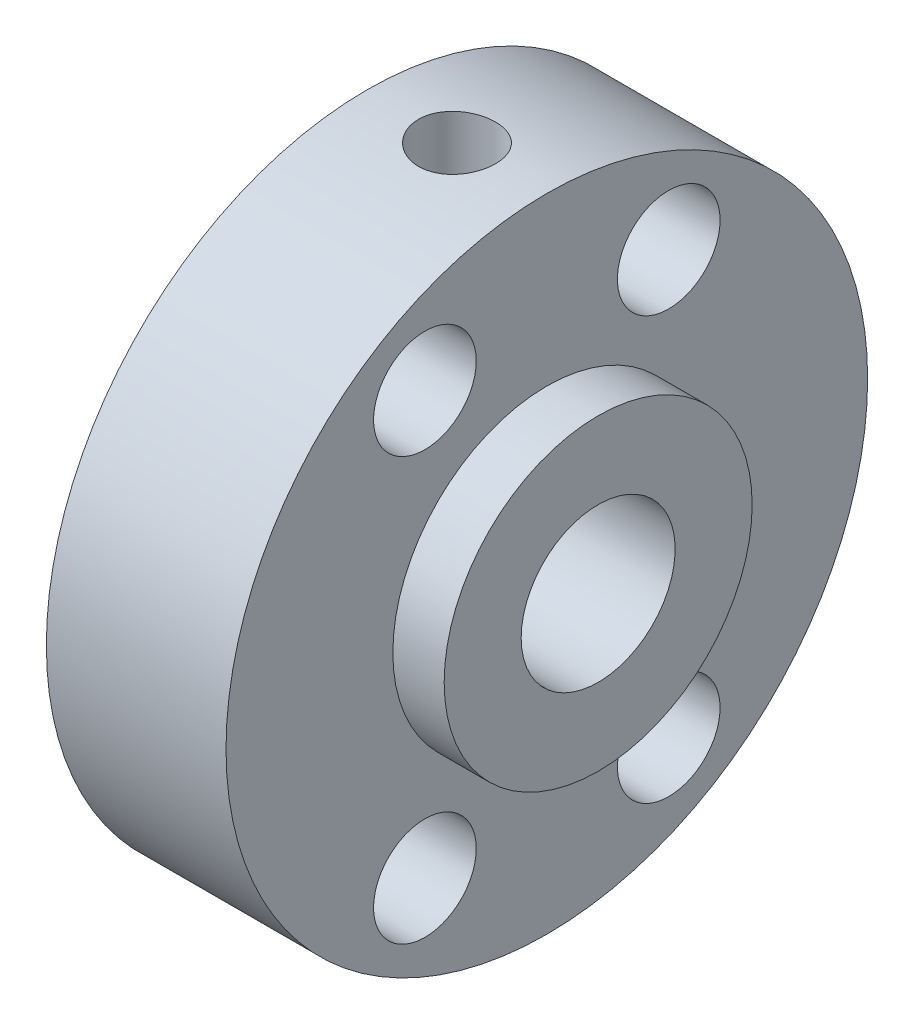
ISO-10303-21;
HEADER;
FILE_DESCRIPTION(('STEP AP214'),'2;1');
FILE_NAME('part.step','',(''),(''),'','','');
FILE_SCHEMA(('AUTOMOTIVE_DESIGN { 1 0 10303 214 1 1 1 1 }'));
ENDSEC;
DATA;
#1=APPLICATION_CONTEXT('core data for automotive mechanical design processes');
#2=APPLICATION_PROTOCOL_DEFINITION('international standard','automotive_design',2000,#1);
#3=PRODUCT_CONTEXT('',#1,'mechanical');
#4=PRODUCT('Part','Part','',(#3));
#5=PRODUCT_RELATED_PRODUCT_CATEGORY('part','',(#4));
#6=PRODUCT_DEFINITION_FORMATION('','',#4);
#7=PRODUCT_DEFINITION_CONTEXT('part definition',#1,'design');
#8=PRODUCT_DEFINITION('design','',#6,#7);
#9=PRODUCT_DEFINITION_SHAPE('','',#8);
#10=(LENGTH_UNIT() NAMED_UNIT(*) SI_UNIT(.MILLI.,.METRE.));
#11=(NAMED_UNIT(*) PLANE_ANGLE_UNIT() SI_UNIT($,.RADIAN.));
#12=(NAMED_UNIT(*) SI_UNIT($,.STERADIAN.) SOLID_ANGLE_UNIT());
#13=UNCERTAINTY_MEASURE_WITH_UNIT(LENGTH_MEASURE(1.E-05),#10,'distance_accuracy_value','');
#14=(GEOMETRIC_REPRESENTATION_CONTEXT(3) GLOBAL_UNCERTAINTY_ASSIGNED_CONTEXT((#13)) GLOBAL_UNIT_ASSIGNED_CONTEXT((#10,
#11,#12)) REPRESENTATION_CONTEXT('',''));
#15=CARTESIAN_POINT('',(0.,0.,0.));
#16=DIRECTION('',(0.,0.,1.));
#17=DIRECTION('',(1.,0.,0.));
#18=AXIS2_PLACEMENT_3D('',#15,#16,#17);
#19=CARTESIAN_POINT('',(0.,0.,0.));
#20=DIRECTION('',(-1.,0.,0.));
#21=DIRECTION('',(0.,0.,1.));
#22=AXIS2_PLACEMENT_3D('',#19,#20,#21);
#23=CYLINDRICAL_SURFACE('',#22,3.);
#24=CARTESIAN_POINT('',(9.,0.,0.));
#25=DIRECTION('',(-1.,0.,0.));
#26=DIRECTION('',(0.,0.,1.));
#27=AXIS2_PLACEMENT_3D('',#24,#25,#26);
#28=CIRCLE('',#27,3.);
#29=CARTESIAN_POINT('',(9.,0.,3.));
#30=VERTEX_POINT('',#29);
#31=EDGE_CURVE('E59',#30,#30,#28,.T.);
#32=ORIENTED_EDGE('',*,*,#31,.F.);
#33=EDGE_LOOP('',(#32));
#34=FACE_BOUND('',#33,.T.);
#35=CARTESIAN_POINT('',(0.,0.,0.));
#36=DIRECTION('',(-1.,0.,0.));
#37=DIRECTION('',(0.,0.,1.));
#38=AXIS2_PLACEMENT_3D('',#35,#36,#37);
#39=CIRCLE('',#38,3.);
#40=CARTESIAN_POINT('',(0.,0.,3.));
#41=VERTEX_POINT('',#40);
#42=EDGE_CURVE('E10',#41,#41,#39,.T.);
#43=ORIENTED_EDGE('',*,*,#42,.T.);
#44=EDGE_LOOP('',(#43));
#45=FACE_BOUND('',#44,.T.);
#46=CARTESIAN_POINT('',(3.5,2.59807621135332,-1.5));
#47=CARTESIAN_POINT('',(3.57816171229288,2.59808302092689,-1.4999945446118));
#48=CARTESIAN_POINT('',(3.65642211728757,2.60165701781635,-1.49384995609982));
#49=CARTESIAN_POINT('',(3.81054089701573,2.61543549678079,-1.46958481484708));
#50=CARTESIAN_POINT('',(3.88639387256511,2.62565391083339,-1.45143909683127));
#51=CARTESIAN_POINT('',(4.03317749651591,2.65124019908098,-1.40414992304972));
#52=CARTESIAN_POINT('',(4.10413197871038,2.66658065209878,-1.3750649287406));
#53=CARTESIAN_POINT('',(4.24013630299508,2.70063997225287,-1.30690128806456));
#54=CARTESIAN_POINT('',(4.30518582539369,2.71935902214097,-1.26782210105366));
#55=CARTESIAN_POINT('',(4.43345859283626,2.75995303586162,-1.17699981079632));
#56=CARTESIAN_POINT('',(4.49608870351032,2.7819609545693,-1.12447805421565));
#57=CARTESIAN_POINT('',(4.61211258261006,2.82557974178559,-1.0098807114217));
#58=CARTESIAN_POINT('',(4.66550174387528,2.84719040746875,-0.947800388673439));
#59=CARTESIAN_POINT('',(4.76505072672149,2.88932215429424,-0.810734345121818));
#60=CARTESIAN_POINT('',(4.81048065178929,2.90967159627259,-0.735160783518861));
#61=CARTESIAN_POINT('',(4.88771127986864,2.94526134149293,-0.576235539899255));
#62=CARTESIAN_POINT('',(4.91952058420575,2.96050486775612,-0.492888807207232));
#63=CARTESIAN_POINT('',(4.96625699195164,2.98320691866356,-0.327067415888966));
#64=CARTESIAN_POINT('',(4.9822242895333,2.99114220331338,-0.244952685733226));
#65=CARTESIAN_POINT('',(5.00024917801256,3.000113757691,-0.0788559430467724));
#66=CARTESIAN_POINT('',(5.00231518519356,3.00115420176885,0.00512490876560744));
#67=CARTESIAN_POINT('',(4.99287998904448,2.99644472874675,0.164748786635625));
#68=CARTESIAN_POINT('',(4.98254297671817,2.99127743838241,0.240481798765187));
#69=CARTESIAN_POINT('',(4.95067873414301,2.97561367889621,0.388970657877483));
#70=CARTESIAN_POINT('',(4.92915066653566,2.96511681099591,0.461726281640888));
#71=CARTESIAN_POINT('',(4.87537615086528,2.93957374931482,0.60346408735433));
#72=CARTESIAN_POINT('',(4.8429855302419,2.92446662293799,0.672380135272767));
#73=CARTESIAN_POINT('',(4.76860487569776,2.89106468980031,0.803965202269992));
#74=CARTESIAN_POINT('',(4.72661140504647,2.87276874236226,0.866631973257968));
#75=CARTESIAN_POINT('',(4.62965697270048,2.83266591598844,0.990260491347292));
#76=CARTESIAN_POINT('',(4.57384545751099,2.81069063997263,1.05050111254404));
#77=CARTESIAN_POINT('',(4.45311541260473,2.76681510880218,1.16115655544667));
#78=CARTESIAN_POINT('',(4.38818994158891,2.74491492398443,1.21156381736135));
#79=CARTESIAN_POINT('',(4.24602771136387,2.70216234138727,1.30425800196332));
#80=CARTESIAN_POINT('',(4.16827096541868,2.68146479986061,1.34582597246708));
#81=CARTESIAN_POINT('',(4.0055934929615,2.64563175417864,1.41497866950185));
#82=CARTESIAN_POINT('',(3.92068035047366,2.63049045069101,1.44257798731633));
#83=CARTESIAN_POINT('',(3.75317823307581,2.60916953725552,1.48077031653756));
#84=CARTESIAN_POINT('',(3.67093832143467,2.60237483772745,1.49253768317996));
#85=CARTESIAN_POINT('',(3.50539798772519,2.59676879042414,1.50227541991714));
#86=CARTESIAN_POINT('',(3.42209835632032,2.59795180333967,1.50025553597254));
#87=CARTESIAN_POINT('',(3.26651912213191,2.60751504810877,1.48355406501595));
#88=CARTESIAN_POINT('',(3.19403082333811,2.61509381259981,1.4702817250687));
#89=CARTESIAN_POINT('',(3.05244832059356,2.63541032327012,1.43354442694866));
#90=CARTESIAN_POINT('',(2.98335522388009,2.64814974007551,1.41007616793542));
#91=CARTESIAN_POINT('',(2.84688300364596,2.67804333119485,1.35247138290733));
#92=CARTESIAN_POINT('',(2.77973147471967,2.69537464864595,1.31789109553908));
#93=CARTESIAN_POINT('',(2.65179609269151,2.73234179245875,1.23943059602371));
#94=CARTESIAN_POINT('',(2.59101553473008,2.75197880032721,1.19554560649832));
#95=CARTESIAN_POINT('',(2.46953184871468,2.79431997684504,1.09325575079828));
#96=CARTESIAN_POINT('',(2.40980427392351,2.81709874731434,1.03371790847245));
#97=CARTESIAN_POINT('',(2.30088164300961,2.86101352466839,0.905106743097433));
#98=CARTESIAN_POINT('',(2.25169014465419,2.88214897511564,0.83603021198302));
#99=CARTESIAN_POINT('',(2.16413941107485,2.92112042536435,0.687803043838135));
#100=CARTESIAN_POINT('',(2.12610032268364,2.93885462508044,0.608434646361169));
#101=CARTESIAN_POINT('',(2.06429314421391,2.96825032438951,0.443283546961623));
#102=CARTESIAN_POINT('',(2.04051252295054,2.97991715514559,0.357506552088264));
#103=CARTESIAN_POINT('',(2.00994715373801,2.99501262272824,0.190469523495626));
#104=CARTESIAN_POINT('',(2.00180318618583,2.99909891862287,0.109517165775686));
#105=CARTESIAN_POINT('',(1.9987351018184,3.00063195562697,-0.0526889789268051));
#106=CARTESIAN_POINT('',(2.00380635721466,2.99808102100335,-0.13394265044263));
#107=CARTESIAN_POINT('',(2.02612461019344,2.98700953256884,-0.28880698847572));
#108=CARTESIAN_POINT('',(2.04254727388651,2.97889342001985,-0.362568476716895));
#109=CARTESIAN_POINT('',(2.08599049895446,2.95788140495135,-0.506168928275426));
#110=CARTESIAN_POINT('',(2.11301258014018,2.94498481699194,-0.576007327433263));
#111=CARTESIAN_POINT('',(2.17809057824896,2.9148889612218,-0.713135109367326));
#112=CARTESIAN_POINT('',(2.21656898481176,2.89752925798199,-0.780187714050069));
#113=CARTESIAN_POINT('',(2.30293689628858,2.86032199712739,-0.907161962721036));
#114=CARTESIAN_POINT('',(2.35083072367351,2.84047329837541,-0.96708031112236));
#115=CARTESIAN_POINT('',(2.46019570853405,2.79792915339941,-1.08437100623534));
#116=CARTESIAN_POINT('',(2.52254373121579,2.77514698517547,-1.14089652680891));
#117=CARTESIAN_POINT('',(2.65617608169466,2.73094614244278,-1.24299493109201));
#118=CARTESIAN_POINT('',(2.72746823130153,2.70952868642798,-1.28855812501509));
#119=CARTESIAN_POINT('',(2.87995496987143,2.66999407957374,-1.36864661967848));
#120=CARTESIAN_POINT('',(2.9613912966931,2.65200261384405,-1.40277759894141));
#121=CARTESIAN_POINT('',(3.12999860650967,2.62299234492527,-1.45631806425962));
#122=CARTESIAN_POINT('',(3.21714933336903,2.61195024221553,-1.47577678676302));
#123=CARTESIAN_POINT('',(3.33770803347799,2.60293908902686,-1.49155051179662));
#124=CARTESIAN_POINT('',(3.37005184159682,2.60112193507728,-1.49471415744578));
#125=CARTESIAN_POINT('',(3.43492472102337,2.59868903831625,-1.49894010763494));
#126=CARTESIAN_POINT('',(3.46745380457881,2.59807337587664,-1.50000227159981));
#127=CARTESIAN_POINT('',(3.5,2.59807621135332,-1.5));
#128=B_SPLINE_CURVE_WITH_KNOTS('',3,(#46,#47,#48,#49,#50,#51,#52,#53,#54,#55,#56,#57,#58,#59,
#60,#61,#62,#63,#64,#65,#66,#67,#68,#69,#70,#71,#72,#73,#74,#75,#76,#77,#78,#79,#80,#81,#82,#83,
#84,#85,#86,#87,#88,#89,#90,#91,#92,#93,#94,#95,#96,#97,#98,#99,#100,#101,#102,#103,#104,#105,
#106,#107,#108,#109,#110,#111,#112,#113,#114,#115,#116,#117,#118,#119,#120,#121,#122,#123,#124,
#125,#126,#127),.UNSPECIFIED.,.T.,.F.,(4,2,2,2,2,2,2,2,2,2,2,2,2,2,2,2,2,2,2,2,2,2,2,2,2,2,2,2,
2,2,2,2,2,2,2,2,2,2,2,2,4),(0.,0.234348183892073,0.469189339237207,0.702792893878327,
0.936409088167724,1.18929346874735,1.44230356626556,1.71236838358145,1.98226240445836,
2.23295227451903,2.4834903552906,2.71224146226807,2.94100968776182,3.1729430209672,
3.40495949025407,3.65890787185336,3.91305072368878,4.18333262594172,4.45333161317557,
4.70193436281317,4.95036139782559,5.17161275136038,5.39293578654094,5.62450944609131,
5.85620229330071,6.11710115370919,6.37808797467303,6.64596272119448,6.91360169713157,
7.1566840558423,7.39968130190957,7.62666637307238,7.85368400268019,8.09041126079207,
8.32724745151078,8.587653627751,8.84828914267731,9.11716123557907,9.38512699504139,
9.48270202777963,9.5802835874181),.UNSPECIFIED.);
#129=CARTESIAN_POINT('',(3.5,2.59807621135332,-1.5));
#130=VERTEX_POINT('',#129);
#131=EDGE_CURVE('E84',#130,#130,#128,.T.);
#132=ORIENTED_EDGE('',*,*,#131,.F.);
#133=EDGE_LOOP('',(#132));
#134=FACE_BOUND('',#133,.T.);
#135=ADVANCED_FACE('F31',(#34,#45,#134),#23,.F.);
#136=CARTESIAN_POINT('',(0.,0.,0.));
#137=DIRECTION('',(-1.,0.,0.));
#138=DIRECTION('',(0.,0.,1.));
#139=AXIS2_PLACEMENT_3D('',#136,#137,#138);
#140=CYLINDRICAL_SURFACE('',#139,12.5);
#141=CARTESIAN_POINT('',(0.,0.,0.));
#142=DIRECTION('',(-1.,0.,0.));
#143=DIRECTION('',(0.,0.,1.));
#144=AXIS2_PLACEMENT_3D('',#141,#142,#143);
#145=CIRCLE('',#144,12.5);
#146=CARTESIAN_POINT('',(0.,0.,12.5));
#147=VERTEX_POINT('',#146);
#148=EDGE_CURVE('E44',#147,#147,#145,.T.);
#149=ORIENTED_EDGE('',*,*,#148,.F.);
#150=EDGE_LOOP('',(#149));
#151=FACE_BOUND('',#150,.T.);
#152=CARTESIAN_POINT('',(7.,0.,0.));
#153=DIRECTION('',(-1.,0.,0.));
#154=DIRECTION('',(0.,0.,1.));
#155=AXIS2_PLACEMENT_3D('',#152,#153,#154);
#156=CIRCLE('',#155,12.5);
#157=CARTESIAN_POINT('',(7.,0.,12.5));
#158=VERTEX_POINT('',#157);
#159=EDGE_CURVE('E48',#158,#158,#156,.T.);
#160=ORIENTED_EDGE('',*,*,#159,.T.);
#161=EDGE_LOOP('',(#160));
#162=FACE_BOUND('',#161,.T.);
#163=CARTESIAN_POINT('',(3.5,12.4096736459909,-1.5));
#164=CARTESIAN_POINT('',(3.41607042940482,12.4096748089167,-1.49999641586388));
#165=CARTESIAN_POINT('',(3.3320877399393,12.4105342894214,-1.49293206748169));
#166=CARTESIAN_POINT('',(3.16645769398422,12.4138782255216,-1.46486159354819));
#167=CARTESIAN_POINT('',(3.08481290215949,12.4163643992983,-1.44384072619508));
#168=CARTESIAN_POINT('',(2.92628079724309,12.4226761552619,-1.38848417307918));
#169=CARTESIAN_POINT('',(2.84939036943189,12.426500849368,-1.35415731394874));
#170=CARTESIAN_POINT('',(2.70247642894952,12.4350576249844,-1.27318168778971));
#171=CARTESIAN_POINT('',(2.63245170421602,12.4397895458966,-1.22653510106007));
#172=CARTESIAN_POINT('',(2.50088011419491,12.4496550027324,-1.12198571965019));
#173=CARTESIAN_POINT('',(2.4393738528257,12.4547902908254,-1.06403198625323));
#174=CARTESIAN_POINT('',(2.32693564091905,12.4648680792729,-0.938622932174393));
#175=CARTESIAN_POINT('',(2.2760042070291,12.4698105701984,-0.871167147527067));
#176=CARTESIAN_POINT('',(2.18601673353186,12.4789637011531,-0.728414784233987));
#177=CARTESIAN_POINT('',(2.14699729213018,12.4831720690333,-0.653094976924494));
#178=CARTESIAN_POINT('',(2.08217576980763,12.4903635621621,-0.496912883636388));
#179=CARTESIAN_POINT('',(2.05637323512614,12.4933467294733,-0.41605078804277));
#180=CARTESIAN_POINT('',(2.01883887194828,12.4977393662263,-0.25149392849254));
#181=CARTESIAN_POINT('',(2.00703967327712,12.4991563682204,-0.167814735521689));
#182=CARTESIAN_POINT('',(1.99763820034474,12.5002827183051,0.000347248334282976));
#183=CARTESIAN_POINT('',(2.00003540892089,12.4999921286017,0.0848300098341701));
#184=CARTESIAN_POINT('',(2.01890456092568,12.4977421462633,0.251742833758765));
#185=CARTESIAN_POINT('',(2.0353040524862,12.4957913442169,0.334181218784106));
#186=CARTESIAN_POINT('',(2.081599075858,12.490449821119,0.495127185045588));
#187=CARTESIAN_POINT('',(2.11149484709083,12.4870590745233,0.573634696521302));
#188=CARTESIAN_POINT('',(2.18401136445326,12.4792038952277,0.724715561629688));
#189=CARTESIAN_POINT('',(2.22666361800321,12.4747368094346,0.797273648637692));
#190=CARTESIAN_POINT('',(2.32345944947808,12.465229048358,0.934229460099392));
#191=CARTESIAN_POINT('',(2.37760351320781,12.4601883488298,0.998626839383445));
#192=CARTESIAN_POINT('',(2.49625217477023,12.4500603372648,1.11785860561525));
#193=CARTESIAN_POINT('',(2.56081989068675,12.4449729316271,1.17263019439189));
#194=CARTESIAN_POINT('',(2.69826575683975,12.4353563023037,1.27056795912578));
#195=CARTESIAN_POINT('',(2.77114392958224,12.4308270801297,1.31373410365263));
#196=CARTESIAN_POINT('',(2.92319624507369,12.4228396027608,1.38723839179325));
#197=CARTESIAN_POINT('',(3.00237272062895,12.4193817467283,1.41757175578821));
#198=CARTESIAN_POINT('',(3.16474617975059,12.4139364153306,1.46449505016189));
#199=CARTESIAN_POINT('',(3.24794298505965,12.4119488748366,1.48108558929275));
#200=CARTESIAN_POINT('',(3.41544154818834,12.4096810007818,1.49996964356083));
#201=CARTESIAN_POINT('',(3.49973321794057,12.4093901280317,1.50235142135386));
#202=CARTESIAN_POINT('',(3.66751439042147,12.4105206650573,1.49298299027801));
#203=CARTESIAN_POINT('',(3.75100390884369,12.411942041265,1.48123305845624));
#204=CARTESIAN_POINT('',(3.91454789179899,12.4163273137489,1.44400895971009));
#205=CARTESIAN_POINT('',(3.99461217340466,12.4192864301079,1.41857731249469));
#206=CARTESIAN_POINT('',(4.14933964148798,12.4264098926624,1.35475538396312));
#207=CARTESIAN_POINT('',(4.22400265225152,12.4305742780457,1.31636468129306));
#208=CARTESIAN_POINT('',(4.36620814748731,12.4396643656649,1.22749651360805));
#209=CARTESIAN_POINT('',(4.43371414344065,12.4445936804928,1.17696103570738));
#210=CARTESIAN_POINT('',(4.5593175565059,12.4546467770184,1.06532008918353));
#211=CARTESIAN_POINT('',(4.61741463670294,12.4597705656719,1.0042142422181));
#212=CARTESIAN_POINT('',(4.72285987361746,12.4696675472455,0.87278213633386));
#213=CARTESIAN_POINT('',(4.77015012325571,12.4744387628015,0.802409249708916));
#214=CARTESIAN_POINT('',(4.85223910466455,12.483063621558,0.654668214705289));
#215=CARTESIAN_POINT('',(4.88703807118722,12.4869172820019,0.577300197822207));
#216=CARTESIAN_POINT('',(4.9430605024379,12.4932640215257,0.417959622359992));
#217=CARTESIAN_POINT('',(4.96431775994212,12.4957604851314,0.33599908532359));
#218=CARTESIAN_POINT('',(4.99276337179108,12.4991255682254,0.169640292495738));
#219=CARTESIAN_POINT('',(4.99995230834657,12.4999942550783,0.0852421377306299));
#220=CARTESIAN_POINT('',(5.00004692205616,12.5000056524324,-0.0830300031278303));
#221=CARTESIAN_POINT('',(4.99304201834161,12.4991591682624,-0.166903952329437));
#222=CARTESIAN_POINT('',(4.96513677254876,12.4958567701035,-0.332273612398118));
#223=CARTESIAN_POINT('',(4.94423643502524,12.4934008566421,-0.413769324044744));
#224=CARTESIAN_POINT('',(4.88916099243421,12.4871544009745,-0.572059777991808));
#225=CARTESIAN_POINT('',(4.85498981777275,12.4833642539575,-0.648855904373999));
#226=CARTESIAN_POINT('',(4.7743519652078,12.474869622158,-0.795637705262655));
#227=CARTESIAN_POINT('',(4.72788518779857,12.4701651299761,-0.865623324646851));
#228=CARTESIAN_POINT('',(4.62364315899687,12.4603319681132,-0.997254742124291));
#229=CARTESIAN_POINT('',(4.56580132233712,12.4552009088046,-1.0588476339384));
#230=CARTESIAN_POINT('',(4.44058848142378,12.4451123432295,-1.17148865356204));
#231=CARTESIAN_POINT('',(4.37321521774934,12.4401548784622,-1.22253427406543));
#232=CARTESIAN_POINT('',(4.23057853191475,12.4309559603764,-1.31278537364373));
#233=CARTESIAN_POINT('',(4.15528783586352,12.4267171228205,-1.35194799100155));
#234=CARTESIAN_POINT('',(3.99919112312461,12.419466118837,-1.41701902911872));
#235=CARTESIAN_POINT('',(3.91839126440112,12.4164526081981,-1.44294198213015));
#236=CARTESIAN_POINT('',(3.7809702304473,12.4127313618494,-1.4745350503682));
#237=CARTESIAN_POINT('',(3.72521862402006,12.4115903654975,-1.48407082470974));
#238=CARTESIAN_POINT('',(3.61298603393287,12.4100611186528,-1.49680448454755));
#239=CARTESIAN_POINT('',(3.5565050552187,12.4096728630583,-1.50000241299709));
#240=CARTESIAN_POINT('',(3.5,12.4096736459909,-1.5));
#241=B_SPLINE_CURVE_WITH_KNOTS('',3,(#163,#164,#165,#166,#167,#168,#169,#170,#171,#172,#173,
#174,#175,#176,#177,#178,#179,#180,#181,#182,#183,#184,#185,#186,#187,#188,#189,#190,#191,#192,
#193,#194,#195,#196,#197,#198,#199,#200,#201,#202,#203,#204,#205,#206,#207,#208,#209,#210,#211,
#212,#213,#214,#215,#216,#217,#218,#219,#220,#221,#222,#223,#224,#225,#226,#227,#228,#229,#230,
#231,#232,#233,#234,#235,#236,#237,#238,#239,#240),.UNSPECIFIED.,.T.,.F.,(4,2,2,2,2,2,2,2,2,2,2,
2,2,2,2,2,2,2,2,2,2,2,2,2,2,2,2,2,2,2,2,2,2,2,2,2,2,2,4),(0.,0.25158230660961,0.503430774819312,
0.755112462522262,1.0067496383611,1.25954776660377,1.51235824273611,1.76593780876769,
2.01950866836447,2.27185458608052,2.52419131111312,2.77523023079344,3.02627360403335,
3.27794222677635,3.52962149067918,3.78288622204422,4.03615163930559,4.28951130338294,
4.54285974404081,4.79463277043148,5.0464008609825,5.29739099483104,5.54838929022027,
5.80061125155308,6.05284224246467,6.30639464647639,6.55994228515918,6.81285470170487,
7.06575665136928,7.31707030939075,7.56838388503437,7.81962308616497,8.07086432058376,
8.32362252061905,8.57644073759112,8.83016031080822,9.08360079205962,9.25297814464871,
9.42235434931908),.UNSPECIFIED.);
#242=CARTESIAN_POINT('',(3.5,12.4096736459909,-1.5));
#243=VERTEX_POINT('',#242);
#244=EDGE_CURVE('E35',#243,#243,#241,.T.);
#245=ORIENTED_EDGE('',*,*,#244,.F.);
#246=EDGE_LOOP('',(#245));
#247=FACE_BOUND('',#246,.T.);
#248=ADVANCED_FACE('F125',(#151,#162,#247),#140,.T.);
#249=CARTESIAN_POINT('',(0.,3.,0.));
#250=DIRECTION('',(1.,0.,0.));
#251=DIRECTION('',(0.,0.,-1.));
#252=AXIS2_PLACEMENT_3D('',#249,#250,#251);
#253=PLANE('',#252);
#254=CARTESIAN_POINT('',(0.,8.22724133595217,-4.75000000000001));
#255=DIRECTION('',(1.,0.,0.));
#256=DIRECTION('',(0.,0.,-1.));
#257=AXIS2_PLACEMENT_3D('',#254,#255,#256);
#258=CIRCLE('',#257,2.);
#259=CARTESIAN_POINT('',(0.,8.22724133595217,-6.75000000000001));
#260=VERTEX_POINT('',#259);
#261=EDGE_CURVE('E66',#260,#260,#258,.T.);
#262=ORIENTED_EDGE('',*,*,#261,.T.);
#263=EDGE_LOOP('',(#262));
#264=FACE_BOUND('',#263,.T.);
#265=CARTESIAN_POINT('',(0.,-8.22724133595218,4.75000000000002));
#266=DIRECTION('',(1.,0.,0.));
#267=DIRECTION('',(0.,0.,-1.));
#268=AXIS2_PLACEMENT_3D('',#265,#266,#267);
#269=CIRCLE('',#268,2.);
#270=CARTESIAN_POINT('',(0.,-8.22724133595218,2.75000000000002));
#271=VERTEX_POINT('',#270);
#272=EDGE_CURVE('E72',#271,#271,#269,.T.);
#273=ORIENTED_EDGE('',*,*,#272,.T.);
#274=EDGE_LOOP('',(#273));
#275=FACE_BOUND('',#274,.T.);
#276=CARTESIAN_POINT('',(0.,-8.22724133595216,-4.75000000000002));
#277=DIRECTION('',(1.,0.,0.));
#278=DIRECTION('',(0.,0.,-1.));
#279=AXIS2_PLACEMENT_3D('',#276,#277,#278);
#280=CIRCLE('',#279,2.);
#281=CARTESIAN_POINT('',(0.,-8.22724133595216,-6.75000000000002));
#282=VERTEX_POINT('',#281);
#283=EDGE_CURVE('E73',#282,#282,#280,.T.);
#284=ORIENTED_EDGE('',*,*,#283,.T.);
#285=EDGE_LOOP('',(#284));
#286=FACE_BOUND('',#285,.T.);
#287=CARTESIAN_POINT('',(0.,8.22724133595216,4.75000000000001));
#288=DIRECTION('',(1.,0.,0.));
#289=DIRECTION('',(0.,0.,-1.));
#290=AXIS2_PLACEMENT_3D('',#287,#288,#289);
#291=CIRCLE('',#290,2.);
#292=CARTESIAN_POINT('',(0.,8.22724133595216,2.75000000000001));
#293=VERTEX_POINT('',#292);
#294=EDGE_CURVE('E62',#293,#293,#291,.T.);
#295=ORIENTED_EDGE('',*,*,#294,.T.);
#296=EDGE_LOOP('',(#295));
#297=FACE_BOUND('',#296,.T.);
#298=ORIENTED_EDGE('',*,*,#42,.F.);
#299=EDGE_LOOP('',(#298));
#300=FACE_BOUND('',#299,.T.);
#301=ORIENTED_EDGE('',*,*,#148,.T.);
#302=EDGE_LOOP('',(#301));
#303=FACE_BOUND('',#302,.T.);
#304=ADVANCED_FACE('F123',(#264,#275,#286,#297,#300,#303),#253,.F.);
#305=CARTESIAN_POINT('',(7.,12.5,0.));
#306=DIRECTION('',(-1.,0.,0.));
#307=DIRECTION('',(0.,0.,1.));
#308=AXIS2_PLACEMENT_3D('',#305,#306,#307);
#309=PLANE('',#308);
#310=CARTESIAN_POINT('',(7.,8.22724133595217,-4.75000000000001));
#311=DIRECTION('',(1.,0.,0.));
#312=DIRECTION('',(0.,0.,-1.));
#313=AXIS2_PLACEMENT_3D('',#310,#311,#312);
#314=CIRCLE('',#313,2.);
#315=CARTESIAN_POINT('',(7.,8.22724133595217,-6.75000000000001));
#316=VERTEX_POINT('',#315);
#317=EDGE_CURVE('E76',#316,#316,#314,.T.);
#318=ORIENTED_EDGE('',*,*,#317,.F.);
#319=EDGE_LOOP('',(#318));
#320=FACE_BOUND('',#319,.T.);
#321=CARTESIAN_POINT('',(7.,-8.22724133595218,4.75000000000002));
#322=DIRECTION('',(1.,0.,0.));
#323=DIRECTION('',(0.,0.,-1.));
#324=AXIS2_PLACEMENT_3D('',#321,#322,#323);
#325=CIRCLE('',#324,2.);
#326=CARTESIAN_POINT('',(7.,-8.22724133595218,2.75000000000002));
#327=VERTEX_POINT('',#326);
#328=EDGE_CURVE('E69',#327,#327,#325,.T.);
#329=ORIENTED_EDGE('',*,*,#328,.F.);
#330=EDGE_LOOP('',(#329));
#331=FACE_BOUND('',#330,.T.);
#332=CARTESIAN_POINT('',(7.,-8.22724133595216,-4.75000000000002));
#333=DIRECTION('',(1.,0.,0.));
#334=DIRECTION('',(0.,0.,-1.));
#335=AXIS2_PLACEMENT_3D('',#332,#333,#334);
#336=CIRCLE('',#335,2.);
#337=CARTESIAN_POINT('',(7.,-8.22724133595216,-6.75000000000002));
#338=VERTEX_POINT('',#337);
#339=EDGE_CURVE('E81',#338,#338,#336,.T.);
#340=ORIENTED_EDGE('',*,*,#339,.F.);
#341=EDGE_LOOP('',(#340));
#342=FACE_BOUND('',#341,.T.);
#343=CARTESIAN_POINT('',(7.,8.22724133595216,4.75000000000001));
#344=DIRECTION('',(1.,0.,0.));
#345=DIRECTION('',(0.,0.,-1.));
#346=AXIS2_PLACEMENT_3D('',#343,#344,#345);
#347=CIRCLE('',#346,2.);
#348=CARTESIAN_POINT('',(7.,8.22724133595216,2.75000000000001));
#349=VERTEX_POINT('',#348);
#350=EDGE_CURVE('E63',#349,#349,#347,.T.);
#351=ORIENTED_EDGE('',*,*,#350,.F.);
#352=EDGE_LOOP('',(#351));
#353=FACE_BOUND('',#352,.T.);
#354=ORIENTED_EDGE('',*,*,#159,.F.);
#355=EDGE_LOOP('',(#354));
#356=FACE_BOUND('',#355,.T.);
#357=CARTESIAN_POINT('',(7.,0.,0.));
#358=DIRECTION('',(-1.,0.,0.));
#359=DIRECTION('',(0.,0.,1.));
#360=AXIS2_PLACEMENT_3D('',#357,#358,#359);
#361=CIRCLE('',#360,6.);
#362=CARTESIAN_POINT('',(7.,0.,6.));
#363=VERTEX_POINT('',#362);
#364=EDGE_CURVE('E53',#363,#363,#361,.T.);
#365=ORIENTED_EDGE('',*,*,#364,.T.);
#366=EDGE_LOOP('',(#365));
#367=FACE_BOUND('',#366,.T.);
#368=ADVANCED_FACE('F120',(#320,#331,#342,#353,#356,#367),#309,.F.);
#369=CARTESIAN_POINT('',(0.,0.,0.));
#370=DIRECTION('',(-1.,0.,0.));
#371=DIRECTION('',(0.,0.,1.));
#372=AXIS2_PLACEMENT_3D('',#369,#370,#371);
#373=CYLINDRICAL_SURFACE('',#372,6.);
#374=ORIENTED_EDGE('',*,*,#364,.F.);
#375=EDGE_LOOP('',(#374));
#376=FACE_BOUND('',#375,.T.);
#377=CARTESIAN_POINT('',(9.,0.,0.));
#378=DIRECTION('',(-1.,0.,0.));
#379=DIRECTION('',(0.,0.,1.));
#380=AXIS2_PLACEMENT_3D('',#377,#378,#379);
#381=CIRCLE('',#380,6.);
#382=CARTESIAN_POINT('',(9.,0.,6.));
#383=VERTEX_POINT('',#382);
#384=EDGE_CURVE('E56',#383,#383,#381,.T.);
#385=ORIENTED_EDGE('',*,*,#384,.T.);
#386=EDGE_LOOP('',(#385));
#387=FACE_BOUND('',#386,.T.);
#388=ADVANCED_FACE('F116',(#376,#387),#373,.T.);
#389=CARTESIAN_POINT('',(9.,6.,0.));
#390=DIRECTION('',(-1.,0.,0.));
#391=DIRECTION('',(0.,0.,1.));
#392=AXIS2_PLACEMENT_3D('',#389,#390,#391);
#393=PLANE('',#392);
#394=ORIENTED_EDGE('',*,*,#384,.F.);
#395=EDGE_LOOP('',(#394));
#396=FACE_BOUND('',#395,.T.);
#397=ORIENTED_EDGE('',*,*,#31,.T.);
#398=EDGE_LOOP('',(#397));
#399=FACE_BOUND('',#398,.T.);
#400=ADVANCED_FACE('F112',(#396,#399),#393,.F.);
#401=CARTESIAN_POINT('',(0.,8.22724133595216,4.75000000000001));
#402=DIRECTION('',(1.,0.,0.));
#403=DIRECTION('',(0.,0.,-1.));
#404=AXIS2_PLACEMENT_3D('',#401,#402,#403);
#405=CYLINDRICAL_SURFACE('',#404,2.);
#406=ORIENTED_EDGE('',*,*,#294,.F.);
#407=EDGE_LOOP('',(#406));
#408=FACE_BOUND('',#407,.T.);
#409=ORIENTED_EDGE('',*,*,#350,.T.);
#410=EDGE_LOOP('',(#409));
#411=FACE_BOUND('',#410,.T.);
#412=ADVANCED_FACE('F102',(#408,#411),#405,.F.);
#413=CARTESIAN_POINT('',(0.,-8.22724133595216,-4.75000000000002));
#414=DIRECTION('',(1.,0.,0.));
#415=DIRECTION('',(0.,0.,-1.));
#416=AXIS2_PLACEMENT_3D('',#413,#414,#415);
#417=CYLINDRICAL_SURFACE('',#416,2.);
#418=ORIENTED_EDGE('',*,*,#283,.F.);
#419=EDGE_LOOP('',(#418));
#420=FACE_BOUND('',#419,.T.);
#421=ORIENTED_EDGE('',*,*,#339,.T.);
#422=EDGE_LOOP('',(#421));
#423=FACE_BOUND('',#422,.T.);
#424=ADVANCED_FACE('F97',(#420,#423),#417,.F.);
#425=CARTESIAN_POINT('',(0.,-8.22724133595218,4.75000000000002));
#426=DIRECTION('',(1.,0.,0.));
#427=DIRECTION('',(0.,0.,-1.));
#428=AXIS2_PLACEMENT_3D('',#425,#426,#427);
#429=CYLINDRICAL_SURFACE('',#428,2.);
#430=ORIENTED_EDGE('',*,*,#272,.F.);
#431=EDGE_LOOP('',(#430));
#432=FACE_BOUND('',#431,.T.);
#433=ORIENTED_EDGE('',*,*,#328,.T.);
#434=EDGE_LOOP('',(#433));
#435=FACE_BOUND('',#434,.T.);
#436=ADVANCED_FACE('F101',(#432,#435),#429,.F.);
#437=CARTESIAN_POINT('',(0.,8.22724133595217,-4.75000000000001));
#438=DIRECTION('',(1.,0.,0.));
#439=DIRECTION('',(0.,0.,-1.));
#440=AXIS2_PLACEMENT_3D('',#437,#438,#439);
#441=CYLINDRICAL_SURFACE('',#440,2.);
#442=ORIENTED_EDGE('',*,*,#261,.F.);
#443=EDGE_LOOP('',(#442));
#444=FACE_BOUND('',#443,.T.);
#445=ORIENTED_EDGE('',*,*,#317,.T.);
#446=EDGE_LOOP('',(#445));
#447=FACE_BOUND('',#446,.T.);
#448=ADVANCED_FACE('F95',(#444,#447),#441,.F.);
#449=CARTESIAN_POINT('',(3.5,30.,0.));
#450=DIRECTION('',(0.,-1.,0.));
#451=DIRECTION('',(0.,0.,-1.));
#452=AXIS2_PLACEMENT_3D('',#449,#450,#451);
#453=CYLINDRICAL_SURFACE('',#452,1.5);
#454=ORIENTED_EDGE('',*,*,#244,.T.);
#455=EDGE_LOOP('',(#454));
#456=FACE_BOUND('',#455,.T.);
#457=ORIENTED_EDGE('',*,*,#131,.T.);
#458=EDGE_LOOP('',(#457));
#459=FACE_BOUND('',#458,.T.);
#460=ADVANCED_FACE('F91',(#456,#459),#453,.F.);
#461=CLOSED_SHELL('',(#135,#248,#304,#368,#388,#400,#412,#424,#436,#448,#460));
#462=MANIFOLD_SOLID_BREP('B2',#461);
#463=ADVANCED_BREP_SHAPE_REPRESENTATION('',(#18,#462),#14);
#464=SHAPE_DEFINITION_REPRESENTATION(#9,#463);
ENDSEC;
END-ISO-10303-21;
